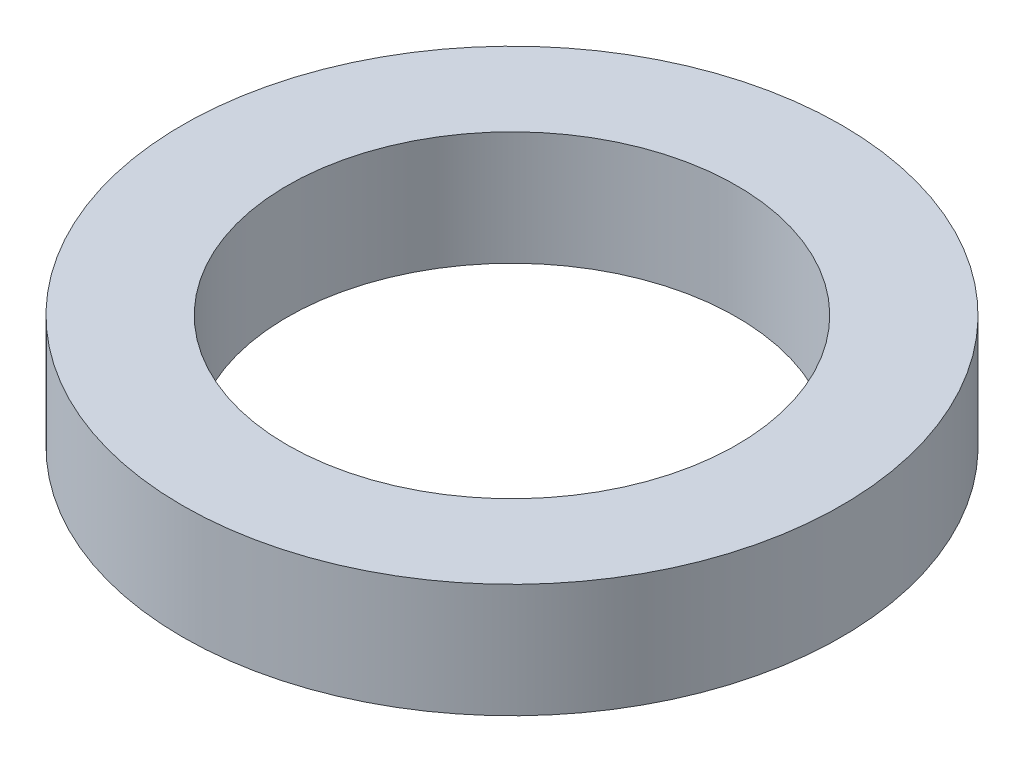
ISO-10303-21;
HEADER;
FILE_DESCRIPTION(('STEP AP214'),'2;1');
FILE_NAME('part.step','',(''),(''),'','','');
FILE_SCHEMA(('AUTOMOTIVE_DESIGN { 1 0 10303 214 1 1 1 1 }'));
ENDSEC;
DATA;
#1=APPLICATION_CONTEXT('core data for automotive mechanical design processes');
#2=APPLICATION_PROTOCOL_DEFINITION('international standard','automotive_design',2000,#1);
#3=PRODUCT_CONTEXT('',#1,'mechanical');
#4=PRODUCT('Part','Part','',(#3));
#5=PRODUCT_RELATED_PRODUCT_CATEGORY('part','',(#4));
#6=PRODUCT_DEFINITION_FORMATION('','',#4);
#7=PRODUCT_DEFINITION_CONTEXT('part definition',#1,'design');
#8=PRODUCT_DEFINITION('design','',#6,#7);
#9=PRODUCT_DEFINITION_SHAPE('','',#8);
#10=(LENGTH_UNIT() NAMED_UNIT(*) SI_UNIT(.MILLI.,.METRE.));
#11=(NAMED_UNIT(*) PLANE_ANGLE_UNIT() SI_UNIT($,.RADIAN.));
#12=(NAMED_UNIT(*) SI_UNIT($,.STERADIAN.) SOLID_ANGLE_UNIT());
#13=UNCERTAINTY_MEASURE_WITH_UNIT(LENGTH_MEASURE(1.E-05),#10,'distance_accuracy_value','');
#14=(GEOMETRIC_REPRESENTATION_CONTEXT(3) GLOBAL_UNCERTAINTY_ASSIGNED_CONTEXT((#13)) GLOBAL_UNIT_ASSIGNED_CONTEXT((#10,
#11,#12)) REPRESENTATION_CONTEXT('',''));
#15=CARTESIAN_POINT('',(0.,0.,0.));
#16=DIRECTION('',(0.,0.,1.));
#17=DIRECTION('',(1.,0.,0.));
#18=AXIS2_PLACEMENT_3D('',#15,#16,#17);
#19=CARTESIAN_POINT('',(0.,19.,0.));
#20=DIRECTION('',(0.,-1.,0.));
#21=DIRECTION('',(0.,0.,-1.));
#22=AXIS2_PLACEMENT_3D('',#19,#20,#21);
#23=CYLINDRICAL_SURFACE('',#22,55.);
#24=CARTESIAN_POINT('',(0.,19.,0.));
#25=DIRECTION('',(0.,1.,0.));
#26=DIRECTION('',(0.,0.,1.));
#27=AXIS2_PLACEMENT_3D('',#24,#25,#26);
#28=CIRCLE('',#27,55.);
#29=CARTESIAN_POINT('',(0.,19.,55.));
#30=VERTEX_POINT('',#29);
#31=EDGE_CURVE('E10',#30,#30,#28,.T.);
#32=ORIENTED_EDGE('',*,*,#31,.F.);
#33=EDGE_LOOP('',(#32));
#34=FACE_BOUND('',#33,.T.);
#35=CARTESIAN_POINT('',(0.,0.,0.));
#36=DIRECTION('',(0.,1.,0.));
#37=DIRECTION('',(0.,0.,1.));
#38=AXIS2_PLACEMENT_3D('',#35,#36,#37);
#39=CIRCLE('',#38,55.);
#40=CARTESIAN_POINT('',(0.,0.,55.));
#41=VERTEX_POINT('',#40);
#42=EDGE_CURVE('E37',#41,#41,#39,.T.);
#43=ORIENTED_EDGE('',*,*,#42,.T.);
#44=EDGE_LOOP('',(#43));
#45=FACE_BOUND('',#44,.T.);
#46=ADVANCED_FACE('F40',(#34,#45),#23,.T.);
#47=CARTESIAN_POINT('',(0.,19.,0.));
#48=DIRECTION('',(0.,1.,0.));
#49=DIRECTION('',(0.,0.,1.));
#50=AXIS2_PLACEMENT_3D('',#47,#48,#49);
#51=PLANE('',#50);
#52=CARTESIAN_POINT('',(0.,19.,0.));
#53=DIRECTION('',(0.,1.,0.));
#54=DIRECTION('',(0.,0.,1.));
#55=AXIS2_PLACEMENT_3D('',#52,#53,#54);
#56=CIRCLE('',#55,37.5);
#57=CARTESIAN_POINT('',(0.,19.,37.5));
#58=VERTEX_POINT('',#57);
#59=EDGE_CURVE('E50',#58,#58,#56,.T.);
#60=ORIENTED_EDGE('',*,*,#59,.F.);
#61=EDGE_LOOP('',(#60));
#62=FACE_BOUND('',#61,.T.);
#63=ORIENTED_EDGE('',*,*,#31,.T.);
#64=EDGE_LOOP('',(#63));
#65=FACE_BOUND('',#64,.T.);
#66=ADVANCED_FACE('F59',(#62,#65),#51,.T.);
#67=CARTESIAN_POINT('',(0.,0.,0.));
#68=DIRECTION('',(0.,1.,0.));
#69=DIRECTION('',(0.,0.,1.));
#70=AXIS2_PLACEMENT_3D('',#67,#68,#69);
#71=PLANE('',#70);
#72=CARTESIAN_POINT('',(0.,0.,0.));
#73=DIRECTION('',(0.,1.,0.));
#74=DIRECTION('',(0.,0.,1.));
#75=AXIS2_PLACEMENT_3D('',#72,#73,#74);
#76=CIRCLE('',#75,37.5);
#77=CARTESIAN_POINT('',(0.,0.,37.5));
#78=VERTEX_POINT('',#77);
#79=EDGE_CURVE('E47',#78,#78,#76,.T.);
#80=ORIENTED_EDGE('',*,*,#79,.T.);
#81=EDGE_LOOP('',(#80));
#82=FACE_BOUND('',#81,.T.);
#83=ORIENTED_EDGE('',*,*,#42,.F.);
#84=EDGE_LOOP('',(#83));
#85=FACE_BOUND('',#84,.T.);
#86=ADVANCED_FACE('F58',(#82,#85),#71,.F.);
#87=CARTESIAN_POINT('',(0.,19.,0.));
#88=DIRECTION('',(0.,-1.,0.));
#89=DIRECTION('',(0.,0.,-1.));
#90=AXIS2_PLACEMENT_3D('',#87,#88,#89);
#91=CYLINDRICAL_SURFACE('',#90,37.5);
#92=ORIENTED_EDGE('',*,*,#59,.T.);
#93=EDGE_LOOP('',(#92));
#94=FACE_BOUND('',#93,.T.);
#95=ORIENTED_EDGE('',*,*,#79,.F.);
#96=EDGE_LOOP('',(#95));
#97=FACE_BOUND('',#96,.T.);
#98=ADVANCED_FACE('F54',(#94,#97),#91,.F.);
#99=CLOSED_SHELL('',(#46,#66,#86,#98));
#100=MANIFOLD_SOLID_BREP('B2',#99);
#101=ADVANCED_BREP_SHAPE_REPRESENTATION('',(#18,#100),#14);
#102=SHAPE_DEFINITION_REPRESENTATION(#9,#101);
ENDSEC;
END-ISO-10303-21;
